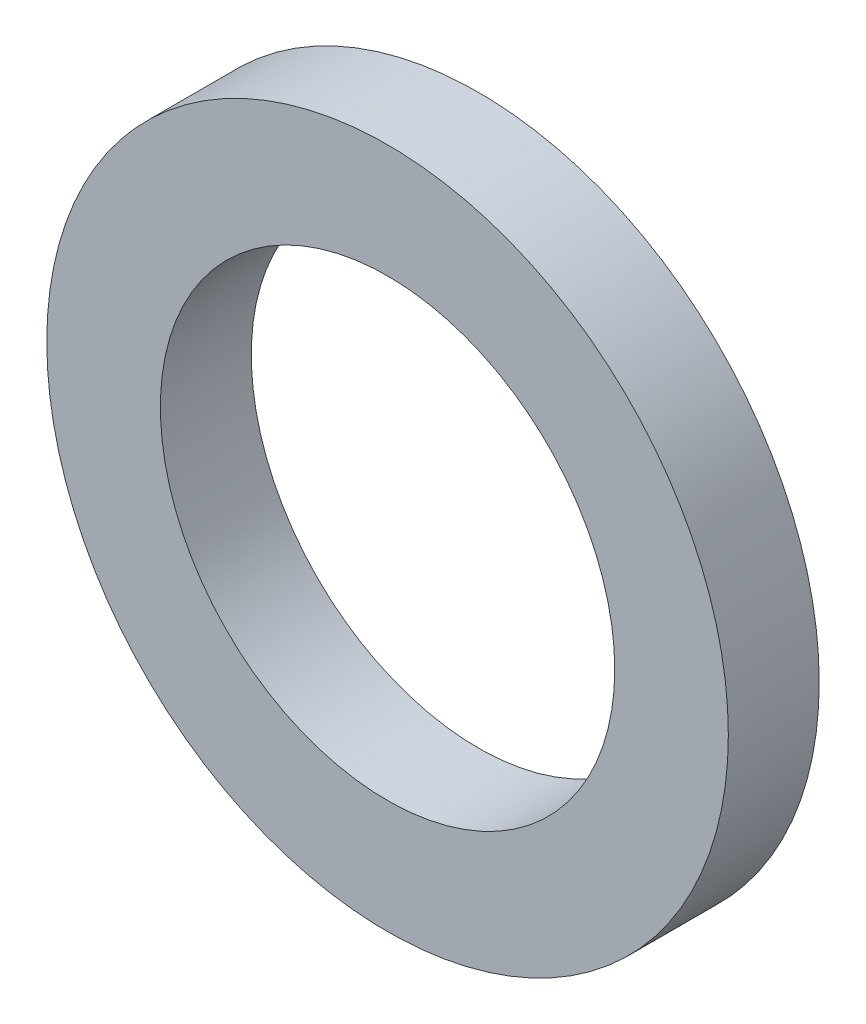
ISO-10303-21;
HEADER;
FILE_DESCRIPTION(('STEP AP214'),'2;1');
FILE_NAME('part.step','',(''),(''),'','','');
FILE_SCHEMA(('AUTOMOTIVE_DESIGN { 1 0 10303 214 1 1 1 1 }'));
ENDSEC;
DATA;
#1=APPLICATION_CONTEXT('core data for automotive mechanical design processes');
#2=APPLICATION_PROTOCOL_DEFINITION('international standard','automotive_design',2000,#1);
#3=PRODUCT_CONTEXT('',#1,'mechanical');
#4=PRODUCT('Part','Part','',(#3));
#5=PRODUCT_RELATED_PRODUCT_CATEGORY('part','',(#4));
#6=PRODUCT_DEFINITION_FORMATION('','',#4);
#7=PRODUCT_DEFINITION_CONTEXT('part definition',#1,'design');
#8=PRODUCT_DEFINITION('design','',#6,#7);
#9=PRODUCT_DEFINITION_SHAPE('','',#8);
#10=(LENGTH_UNIT() NAMED_UNIT(*) SI_UNIT(.MILLI.,.METRE.));
#11=(NAMED_UNIT(*) PLANE_ANGLE_UNIT() SI_UNIT($,.RADIAN.));
#12=(NAMED_UNIT(*) SI_UNIT($,.STERADIAN.) SOLID_ANGLE_UNIT());
#13=UNCERTAINTY_MEASURE_WITH_UNIT(LENGTH_MEASURE(1.E-05),#10,'distance_accuracy_value','');
#14=(GEOMETRIC_REPRESENTATION_CONTEXT(3) GLOBAL_UNCERTAINTY_ASSIGNED_CONTEXT((#13)) GLOBAL_UNIT_ASSIGNED_CONTEXT((#10,
#11,#12)) REPRESENTATION_CONTEXT('',''));
#15=CARTESIAN_POINT('',(0.,0.,0.));
#16=DIRECTION('',(0.,0.,1.));
#17=DIRECTION('',(1.,0.,0.));
#18=AXIS2_PLACEMENT_3D('',#15,#16,#17);
#19=CARTESIAN_POINT('',(0.,0.,2.54));
#20=DIRECTION('',(0.,0.,1.));
#21=DIRECTION('',(1.,0.,0.));
#22=AXIS2_PLACEMENT_3D('',#19,#20,#21);
#23=PLANE('',#22);
#24=CARTESIAN_POINT('',(0.,0.,2.54));
#25=DIRECTION('',(0.,0.,1.));
#26=DIRECTION('',(1.,0.,0.));
#27=AXIS2_PLACEMENT_3D('',#24,#25,#26);
#28=CIRCLE('',#27,9.525);
#29=CARTESIAN_POINT('',(9.525,0.,2.54));
#30=VERTEX_POINT('',#29);
#31=EDGE_CURVE('E10',#30,#30,#28,.T.);
#32=ORIENTED_EDGE('',*,*,#31,.T.);
#33=EDGE_LOOP('',(#32));
#34=FACE_BOUND('',#33,.T.);
#35=CARTESIAN_POINT('',(0.,0.,2.54));
#36=DIRECTION('',(0.,0.,1.));
#37=DIRECTION('',(1.,0.,0.));
#38=AXIS2_PLACEMENT_3D('',#35,#36,#37);
#39=CIRCLE('',#38,6.35);
#40=CARTESIAN_POINT('',(6.35,0.,2.54));
#41=VERTEX_POINT('',#40);
#42=EDGE_CURVE('E50',#41,#41,#39,.T.);
#43=ORIENTED_EDGE('',*,*,#42,.F.);
#44=EDGE_LOOP('',(#43));
#45=FACE_BOUND('',#44,.T.);
#46=ADVANCED_FACE('F37',(#34,#45),#23,.T.);
#47=CARTESIAN_POINT('',(0.,0.,0.));
#48=DIRECTION('',(0.,0.,1.));
#49=DIRECTION('',(1.,0.,0.));
#50=AXIS2_PLACEMENT_3D('',#47,#48,#49);
#51=PLANE('',#50);
#52=CARTESIAN_POINT('',(0.,0.,0.));
#53=DIRECTION('',(0.,0.,1.));
#54=DIRECTION('',(1.,0.,0.));
#55=AXIS2_PLACEMENT_3D('',#52,#53,#54);
#56=CIRCLE('',#55,9.525);
#57=CARTESIAN_POINT('',(9.525,0.,0.));
#58=VERTEX_POINT('',#57);
#59=EDGE_CURVE('E41',#58,#58,#56,.T.);
#60=ORIENTED_EDGE('',*,*,#59,.F.);
#61=EDGE_LOOP('',(#60));
#62=FACE_BOUND('',#61,.T.);
#63=CARTESIAN_POINT('',(0.,0.,0.));
#64=DIRECTION('',(0.,0.,1.));
#65=DIRECTION('',(1.,0.,0.));
#66=AXIS2_PLACEMENT_3D('',#63,#64,#65);
#67=CIRCLE('',#66,6.35);
#68=CARTESIAN_POINT('',(6.35,0.,0.));
#69=VERTEX_POINT('',#68);
#70=EDGE_CURVE('E52',#69,#69,#67,.T.);
#71=ORIENTED_EDGE('',*,*,#70,.T.);
#72=EDGE_LOOP('',(#71));
#73=FACE_BOUND('',#72,.T.);
#74=ADVANCED_FACE('F64',(#62,#73),#51,.F.);
#75=CARTESIAN_POINT('',(0.,0.,2.54));
#76=DIRECTION('',(0.,0.,-1.));
#77=DIRECTION('',(-1.,0.,0.));
#78=AXIS2_PLACEMENT_3D('',#75,#76,#77);
#79=CYLINDRICAL_SURFACE('',#78,9.525);
#80=ORIENTED_EDGE('',*,*,#31,.F.);
#81=EDGE_LOOP('',(#80));
#82=FACE_BOUND('',#81,.T.);
#83=ORIENTED_EDGE('',*,*,#59,.T.);
#84=EDGE_LOOP('',(#83));
#85=FACE_BOUND('',#84,.T.);
#86=ADVANCED_FACE('F39',(#82,#85),#79,.T.);
#87=CARTESIAN_POINT('',(0.,0.,2.54));
#88=DIRECTION('',(0.,0.,-1.));
#89=DIRECTION('',(-1.,0.,0.));
#90=AXIS2_PLACEMENT_3D('',#87,#88,#89);
#91=CYLINDRICAL_SURFACE('',#90,6.35);
#92=ORIENTED_EDGE('',*,*,#42,.T.);
#93=EDGE_LOOP('',(#92));
#94=FACE_BOUND('',#93,.T.);
#95=ORIENTED_EDGE('',*,*,#70,.F.);
#96=EDGE_LOOP('',(#95));
#97=FACE_BOUND('',#96,.T.);
#98=ADVANCED_FACE('F60',(#94,#97),#91,.F.);
#99=CLOSED_SHELL('',(#46,#74,#86,#98));
#100=MANIFOLD_SOLID_BREP('B2',#99);
#101=ADVANCED_BREP_SHAPE_REPRESENTATION('',(#18,#100),#14);
#102=SHAPE_DEFINITION_REPRESENTATION(#9,#101);
ENDSEC;
END-ISO-10303-21;
